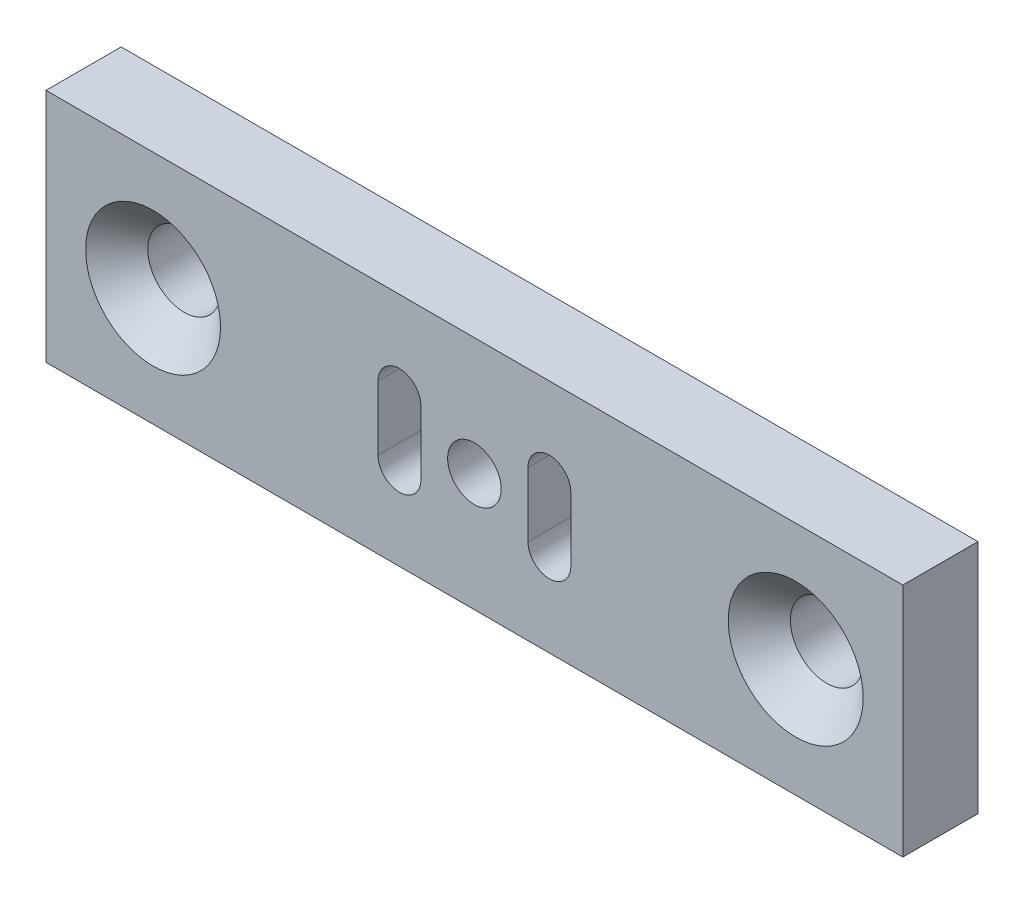
ISO-10303-21;
HEADER;
FILE_DESCRIPTION(('STEP AP214'),'2;1');
FILE_NAME('part.step','',(''),(''),'','','');
FILE_SCHEMA(('AUTOMOTIVE_DESIGN { 1 0 10303 214 1 1 1 1 }'));
ENDSEC;
DATA;
#1=APPLICATION_CONTEXT('core data for automotive mechanical design processes');
#2=APPLICATION_PROTOCOL_DEFINITION('international standard','automotive_design',2000,#1);
#3=PRODUCT_CONTEXT('',#1,'mechanical');
#4=PRODUCT('Part','Part','',(#3));
#5=PRODUCT_RELATED_PRODUCT_CATEGORY('part','',(#4));
#6=PRODUCT_DEFINITION_FORMATION('','',#4);
#7=PRODUCT_DEFINITION_CONTEXT('part definition',#1,'design');
#8=PRODUCT_DEFINITION('design','',#6,#7);
#9=PRODUCT_DEFINITION_SHAPE('','',#8);
#10=(LENGTH_UNIT() NAMED_UNIT(*) SI_UNIT(.MILLI.,.METRE.));
#11=(NAMED_UNIT(*) PLANE_ANGLE_UNIT() SI_UNIT($,.RADIAN.));
#12=(NAMED_UNIT(*) SI_UNIT($,.STERADIAN.) SOLID_ANGLE_UNIT());
#13=UNCERTAINTY_MEASURE_WITH_UNIT(LENGTH_MEASURE(1.E-05),#10,'distance_accuracy_value','');
#14=(GEOMETRIC_REPRESENTATION_CONTEXT(3) GLOBAL_UNCERTAINTY_ASSIGNED_CONTEXT((#13)) GLOBAL_UNIT_ASSIGNED_CONTEXT((#10,
#11,#12)) REPRESENTATION_CONTEXT('',''));
#15=CARTESIAN_POINT('',(0.,0.,0.));
#16=DIRECTION('',(0.,0.,1.));
#17=DIRECTION('',(1.,0.,0.));
#18=AXIS2_PLACEMENT_3D('',#15,#16,#17);
#19=CARTESIAN_POINT('',(-20.,-5.5,9.51));
#20=DIRECTION('',(1.,0.,0.));
#21=DIRECTION('',(0.,1.,0.));
#22=AXIS2_PLACEMENT_3D('',#19,#20,#21);
#23=PLANE('',#22);
#24=DIRECTION('',(0.,1.,0.));
#25=VECTOR('',#24,1.);
#26=CARTESIAN_POINT('',(-20.,-5.5,13.));
#27=LINE('',#26,#25);
#28=CARTESIAN_POINT('',(-20.,-5.5,13.));
#29=VERTEX_POINT('',#28);
#30=CARTESIAN_POINT('',(-20.,5.5,13.));
#31=VERTEX_POINT('',#30);
#32=EDGE_CURVE('E48',#29,#31,#27,.T.);
#33=ORIENTED_EDGE('',*,*,#32,.F.);
#34=DIRECTION('',(0.,0.,-1.));
#35=VECTOR('',#34,1.);
#36=CARTESIAN_POINT('',(-20.,-5.5,9.51));
#37=LINE('',#36,#35);
#38=CARTESIAN_POINT('',(-20.,-5.5,16.51));
#39=VERTEX_POINT('',#38);
#40=EDGE_CURVE('E11',#39,#29,#37,.T.);
#41=ORIENTED_EDGE('',*,*,#40,.F.);
#42=DIRECTION('',(0.,-1.,0.));
#43=VECTOR('',#42,1.);
#44=CARTESIAN_POINT('',(-20.,5.5,16.51));
#45=LINE('',#44,#43);
#46=CARTESIAN_POINT('',(-20.,5.5,16.51));
#47=VERTEX_POINT('',#46);
#48=EDGE_CURVE('E177',#47,#39,#45,.T.);
#49=ORIENTED_EDGE('',*,*,#48,.F.);
#50=DIRECTION('',(0.,0.,-1.));
#51=VECTOR('',#50,1.);
#52=CARTESIAN_POINT('',(-20.,5.5,9.51));
#53=LINE('',#52,#51);
#54=EDGE_CURVE('E189',#47,#31,#53,.T.);
#55=ORIENTED_EDGE('',*,*,#54,.T.);
#56=EDGE_LOOP('',(#33,#41,#49,#55));
#57=FACE_BOUND('',#56,.T.);
#58=ADVANCED_FACE('F33',(#57),#23,.F.);
#59=CARTESIAN_POINT('',(20.,-5.5,9.51));
#60=DIRECTION('',(0.,1.,0.));
#61=DIRECTION('',(0.,0.,1.));
#62=AXIS2_PLACEMENT_3D('',#59,#60,#61);
#63=PLANE('',#62);
#64=DIRECTION('',(-1.,0.,0.));
#65=VECTOR('',#64,1.);
#66=CARTESIAN_POINT('',(20.,-5.5,13.));
#67=LINE('',#66,#65);
#68=CARTESIAN_POINT('',(20.,-5.5,13.));
#69=VERTEX_POINT('',#68);
#70=EDGE_CURVE('E205',#69,#29,#67,.T.);
#71=ORIENTED_EDGE('',*,*,#70,.F.);
#72=DIRECTION('',(0.,0.,-1.));
#73=VECTOR('',#72,1.);
#74=CARTESIAN_POINT('',(20.,-5.5,9.51));
#75=LINE('',#74,#73);
#76=CARTESIAN_POINT('',(20.,-5.5,16.51));
#77=VERTEX_POINT('',#76);
#78=EDGE_CURVE('E41',#77,#69,#75,.T.);
#79=ORIENTED_EDGE('',*,*,#78,.F.);
#80=DIRECTION('',(1.,0.,0.));
#81=VECTOR('',#80,1.);
#82=CARTESIAN_POINT('',(-20.,-5.5,16.51));
#83=LINE('',#82,#81);
#84=EDGE_CURVE('E180',#39,#77,#83,.T.);
#85=ORIENTED_EDGE('',*,*,#84,.F.);
#86=ORIENTED_EDGE('',*,*,#40,.T.);
#87=EDGE_LOOP('',(#71,#79,#85,#86));
#88=FACE_BOUND('',#87,.T.);
#89=ADVANCED_FACE('F204',(#88),#63,.F.);
#90=CARTESIAN_POINT('',(20.,-5.5,9.51));
#91=DIRECTION('',(-1.,0.,0.));
#92=DIRECTION('',(0.,0.,1.));
#93=AXIS2_PLACEMENT_3D('',#90,#91,#92);
#94=PLANE('',#93);
#95=DIRECTION('',(0.,-1.,0.));
#96=VECTOR('',#95,1.);
#97=CARTESIAN_POINT('',(20.,-5.5,13.));
#98=LINE('',#97,#96);
#99=CARTESIAN_POINT('',(20.,5.5,13.));
#100=VERTEX_POINT('',#99);
#101=EDGE_CURVE('E200',#100,#69,#98,.T.);
#102=ORIENTED_EDGE('',*,*,#101,.F.);
#103=DIRECTION('',(0.,0.,-1.));
#104=VECTOR('',#103,1.);
#105=CARTESIAN_POINT('',(20.,5.5,9.51));
#106=LINE('',#105,#104);
#107=CARTESIAN_POINT('',(20.,5.5,16.51));
#108=VERTEX_POINT('',#107);
#109=EDGE_CURVE('E192',#108,#100,#106,.T.);
#110=ORIENTED_EDGE('',*,*,#109,.F.);
#111=DIRECTION('',(0.,1.,0.));
#112=VECTOR('',#111,1.);
#113=CARTESIAN_POINT('',(20.,5.5,16.51));
#114=LINE('',#113,#112);
#115=EDGE_CURVE('E183',#77,#108,#114,.T.);
#116=ORIENTED_EDGE('',*,*,#115,.F.);
#117=ORIENTED_EDGE('',*,*,#78,.T.);
#118=EDGE_LOOP('',(#102,#110,#116,#117));
#119=FACE_BOUND('',#118,.T.);
#120=ADVANCED_FACE('F199',(#119),#94,.F.);
#121=CARTESIAN_POINT('',(20.,5.5,9.51));
#122=DIRECTION('',(0.,-1.,0.));
#123=DIRECTION('',(0.,0.,-1.));
#124=AXIS2_PLACEMENT_3D('',#121,#122,#123);
#125=PLANE('',#124);
#126=DIRECTION('',(1.,0.,0.));
#127=VECTOR('',#126,1.);
#128=CARTESIAN_POINT('',(20.,5.5,13.));
#129=LINE('',#128,#127);
#130=EDGE_CURVE('E264',#31,#100,#129,.T.);
#131=ORIENTED_EDGE('',*,*,#130,.F.);
#132=ORIENTED_EDGE('',*,*,#54,.F.);
#133=DIRECTION('',(-1.,0.,0.));
#134=VECTOR('',#133,1.);
#135=CARTESIAN_POINT('',(-20.,5.5,16.51));
#136=LINE('',#135,#134);
#137=EDGE_CURVE('E186',#108,#47,#136,.T.);
#138=ORIENTED_EDGE('',*,*,#137,.F.);
#139=ORIENTED_EDGE('',*,*,#109,.T.);
#140=EDGE_LOOP('',(#131,#132,#138,#139));
#141=FACE_BOUND('',#140,.T.);
#142=ADVANCED_FACE('F258',(#141),#125,.F.);
#143=CARTESIAN_POINT('',(0.,0.,16.51));
#144=DIRECTION('',(0.,0.,1.));
#145=DIRECTION('',(1.,0.,0.));
#146=AXIS2_PLACEMENT_3D('',#143,#144,#145);
#147=CYLINDRICAL_SURFACE('',#146,1.24999999999999);
#148=CARTESIAN_POINT('',(0.,0.,16.51));
#149=DIRECTION('',(0.,0.,1.));
#150=DIRECTION('',(1.,0.,0.));
#151=AXIS2_PLACEMENT_3D('',#148,#149,#150);
#152=CIRCLE('',#151,1.24999999999999);
#153=CARTESIAN_POINT('',(1.24999999999999,0.,16.51));
#154=VERTEX_POINT('',#153);
#155=EDGE_CURVE('E169',#154,#154,#152,.T.);
#156=ORIENTED_EDGE('',*,*,#155,.T.);
#157=EDGE_LOOP('',(#156));
#158=FACE_BOUND('',#157,.T.);
#159=CARTESIAN_POINT('',(0.,0.,13.));
#160=DIRECTION('',(0.,0.,-1.));
#161=DIRECTION('',(-1.,0.,0.));
#162=AXIS2_PLACEMENT_3D('',#159,#160,#161);
#163=CIRCLE('',#162,1.24999999999999);
#164=CARTESIAN_POINT('',(-1.24999999999999,0.,13.));
#165=VERTEX_POINT('',#164);
#166=EDGE_CURVE('E262',#165,#165,#163,.F.);
#167=ORIENTED_EDGE('',*,*,#166,.F.);
#168=EDGE_LOOP('',(#167));
#169=FACE_BOUND('',#168,.T.);
#170=ADVANCED_FACE('F254',(#158,#169),#147,.F.);
#171=CARTESIAN_POINT('',(-3.5,1.5,9.51));
#172=DIRECTION('',(0.,0.,1.));
#173=DIRECTION('',(1.,0.,0.));
#174=AXIS2_PLACEMENT_3D('',#171,#172,#173);
#175=CYLINDRICAL_SURFACE('',#174,1.);
#176=CARTESIAN_POINT('',(-3.5,1.5,13.));
#177=DIRECTION('',(0.,0.,-1.));
#178=DIRECTION('',(-1.,0.,0.));
#179=AXIS2_PLACEMENT_3D('',#176,#177,#178);
#180=CIRCLE('',#179,1.);
#181=CARTESIAN_POINT('',(-2.5,1.5,13.));
#182=VERTEX_POINT('',#181);
#183=CARTESIAN_POINT('',(-4.5,1.5,13.));
#184=VERTEX_POINT('',#183);
#185=EDGE_CURVE('E56',#182,#184,#180,.F.);
#186=ORIENTED_EDGE('',*,*,#185,.F.);
#187=DIRECTION('',(0.,0.,1.));
#188=VECTOR('',#187,1.);
#189=CARTESIAN_POINT('',(-2.5,1.5,9.51));
#190=LINE('',#189,#188);
#191=CARTESIAN_POINT('',(-2.5,1.5,16.51));
#192=VERTEX_POINT('',#191);
#193=EDGE_CURVE('E167',#182,#192,#190,.T.);
#194=ORIENTED_EDGE('',*,*,#193,.T.);
#195=CARTESIAN_POINT('',(-3.5,1.5,16.51));
#196=DIRECTION('',(0.,0.,1.));
#197=DIRECTION('',(1.,0.,0.));
#198=AXIS2_PLACEMENT_3D('',#195,#196,#197);
#199=CIRCLE('',#198,1.);
#200=CARTESIAN_POINT('',(-4.5,1.5,16.51));
#201=VERTEX_POINT('',#200);
#202=EDGE_CURVE('E154',#192,#201,#199,.T.);
#203=ORIENTED_EDGE('',*,*,#202,.T.);
#204=DIRECTION('',(0.,0.,1.));
#205=VECTOR('',#204,1.);
#206=CARTESIAN_POINT('',(-4.5,1.5,9.51));
#207=LINE('',#206,#205);
#208=EDGE_CURVE('E166',#184,#201,#207,.T.);
#209=ORIENTED_EDGE('',*,*,#208,.F.);
#210=EDGE_LOOP('',(#186,#194,#203,#209));
#211=FACE_BOUND('',#210,.T.);
#212=ADVANCED_FACE('F257',(#211),#175,.F.);
#213=CARTESIAN_POINT('',(-2.5,1.5,9.51));
#214=DIRECTION('',(1.,0.,0.));
#215=DIRECTION('',(0.,1.,0.));
#216=AXIS2_PLACEMENT_3D('',#213,#214,#215);
#217=PLANE('',#216);
#218=DIRECTION('',(0.,1.,0.));
#219=VECTOR('',#218,1.);
#220=CARTESIAN_POINT('',(-2.5,1.5,13.));
#221=LINE('',#220,#219);
#222=CARTESIAN_POINT('',(-2.5,-1.5,13.));
#223=VERTEX_POINT('',#222);
#224=EDGE_CURVE('E267',#223,#182,#221,.T.);
#225=ORIENTED_EDGE('',*,*,#224,.F.);
#226=DIRECTION('',(0.,0.,1.));
#227=VECTOR('',#226,1.);
#228=CARTESIAN_POINT('',(-2.5,-1.5,9.51));
#229=LINE('',#228,#227);
#230=CARTESIAN_POINT('',(-2.5,-1.5,16.51));
#231=VERTEX_POINT('',#230);
#232=EDGE_CURVE('E170',#223,#231,#229,.T.);
#233=ORIENTED_EDGE('',*,*,#232,.T.);
#234=DIRECTION('',(0.,1.,0.));
#235=VECTOR('',#234,1.);
#236=CARTESIAN_POINT('',(-2.5,1.5,16.51));
#237=LINE('',#236,#235);
#238=EDGE_CURVE('E163',#231,#192,#237,.T.);
#239=ORIENTED_EDGE('',*,*,#238,.T.);
#240=ORIENTED_EDGE('',*,*,#193,.F.);
#241=EDGE_LOOP('',(#225,#233,#239,#240));
#242=FACE_BOUND('',#241,.T.);
#243=ADVANCED_FACE('F309',(#242),#217,.F.);
#244=CARTESIAN_POINT('',(-3.5,-1.5,9.51));
#245=DIRECTION('',(0.,0.,1.));
#246=DIRECTION('',(1.,0.,0.));
#247=AXIS2_PLACEMENT_3D('',#244,#245,#246);
#248=CYLINDRICAL_SURFACE('',#247,1.);
#249=CARTESIAN_POINT('',(-3.5,-1.5,13.));
#250=DIRECTION('',(0.,0.,-1.));
#251=DIRECTION('',(-1.,0.,0.));
#252=AXIS2_PLACEMENT_3D('',#249,#250,#251);
#253=CIRCLE('',#252,1.);
#254=CARTESIAN_POINT('',(-4.5,-1.5,13.));
#255=VERTEX_POINT('',#254);
#256=EDGE_CURVE('E443',#255,#223,#253,.F.);
#257=ORIENTED_EDGE('',*,*,#256,.F.);
#258=DIRECTION('',(0.,0.,1.));
#259=VECTOR('',#258,1.);
#260=CARTESIAN_POINT('',(-4.5,-1.5,9.51));
#261=LINE('',#260,#259);
#262=CARTESIAN_POINT('',(-4.5,-1.5,16.51));
#263=VERTEX_POINT('',#262);
#264=EDGE_CURVE('E172',#255,#263,#261,.T.);
#265=ORIENTED_EDGE('',*,*,#264,.T.);
#266=CARTESIAN_POINT('',(-3.5,-1.5,16.51));
#267=DIRECTION('',(0.,0.,1.));
#268=DIRECTION('',(1.,0.,0.));
#269=AXIS2_PLACEMENT_3D('',#266,#267,#268);
#270=CIRCLE('',#269,1.);
#271=EDGE_CURVE('E160',#263,#231,#270,.T.);
#272=ORIENTED_EDGE('',*,*,#271,.T.);
#273=ORIENTED_EDGE('',*,*,#232,.F.);
#274=EDGE_LOOP('',(#257,#265,#272,#273));
#275=FACE_BOUND('',#274,.T.);
#276=ADVANCED_FACE('F319',(#275),#248,.F.);
#277=CARTESIAN_POINT('',(-4.5,1.5,9.51));
#278=DIRECTION('',(-1.,0.,0.));
#279=DIRECTION('',(0.,0.,1.));
#280=AXIS2_PLACEMENT_3D('',#277,#278,#279);
#281=PLANE('',#280);
#282=DIRECTION('',(0.,-1.,0.));
#283=VECTOR('',#282,1.);
#284=CARTESIAN_POINT('',(-4.5,1.5,13.));
#285=LINE('',#284,#283);
#286=EDGE_CURVE('E441',#184,#255,#285,.T.);
#287=ORIENTED_EDGE('',*,*,#286,.F.);
#288=ORIENTED_EDGE('',*,*,#208,.T.);
#289=DIRECTION('',(0.,-1.,0.));
#290=VECTOR('',#289,1.);
#291=CARTESIAN_POINT('',(-4.5,1.5,16.51));
#292=LINE('',#291,#290);
#293=EDGE_CURVE('E157',#201,#263,#292,.T.);
#294=ORIENTED_EDGE('',*,*,#293,.T.);
#295=ORIENTED_EDGE('',*,*,#264,.F.);
#296=EDGE_LOOP('',(#287,#288,#294,#295));
#297=FACE_BOUND('',#296,.T.);
#298=ADVANCED_FACE('F329',(#297),#281,.F.);
#299=CARTESIAN_POINT('',(3.5,1.5,9.51));
#300=DIRECTION('',(0.,0.,1.));
#301=DIRECTION('',(1.,0.,0.));
#302=AXIS2_PLACEMENT_3D('',#299,#300,#301);
#303=CYLINDRICAL_SURFACE('',#302,1.);
#304=CARTESIAN_POINT('',(3.5,1.5,13.));
#305=DIRECTION('',(0.,0.,-1.));
#306=DIRECTION('',(-1.,0.,0.));
#307=AXIS2_PLACEMENT_3D('',#304,#305,#306);
#308=CIRCLE('',#307,1.);
#309=CARTESIAN_POINT('',(4.5,1.5,13.));
#310=VERTEX_POINT('',#309);
#311=CARTESIAN_POINT('',(2.5,1.5,13.));
#312=VERTEX_POINT('',#311);
#313=EDGE_CURVE('E127',#310,#312,#308,.F.);
#314=ORIENTED_EDGE('',*,*,#313,.F.);
#315=DIRECTION('',(0.,0.,1.));
#316=VECTOR('',#315,1.);
#317=CARTESIAN_POINT('',(4.5,1.5,9.51));
#318=LINE('',#317,#316);
#319=CARTESIAN_POINT('',(4.5,1.5,16.51));
#320=VERTEX_POINT('',#319);
#321=EDGE_CURVE('E148',#310,#320,#318,.T.);
#322=ORIENTED_EDGE('',*,*,#321,.T.);
#323=CARTESIAN_POINT('',(3.5,1.5,16.51));
#324=DIRECTION('',(0.,0.,1.));
#325=DIRECTION('',(1.,0.,0.));
#326=AXIS2_PLACEMENT_3D('',#323,#324,#325);
#327=CIRCLE('',#326,1.);
#328=CARTESIAN_POINT('',(2.5,1.5,16.51));
#329=VERTEX_POINT('',#328);
#330=EDGE_CURVE('E227',#320,#329,#327,.T.);
#331=ORIENTED_EDGE('',*,*,#330,.T.);
#332=DIRECTION('',(0.,0.,1.));
#333=VECTOR('',#332,1.);
#334=CARTESIAN_POINT('',(2.5,1.5,9.51));
#335=LINE('',#334,#333);
#336=EDGE_CURVE('E146',#312,#329,#335,.T.);
#337=ORIENTED_EDGE('',*,*,#336,.F.);
#338=EDGE_LOOP('',(#314,#322,#331,#337));
#339=FACE_BOUND('',#338,.T.);
#340=ADVANCED_FACE('F236',(#339),#303,.F.);
#341=CARTESIAN_POINT('',(4.5,1.5,9.51));
#342=DIRECTION('',(1.,0.,0.));
#343=DIRECTION('',(0.,1.,0.));
#344=AXIS2_PLACEMENT_3D('',#341,#342,#343);
#345=PLANE('',#344);
#346=DIRECTION('',(0.,1.,0.));
#347=VECTOR('',#346,1.);
#348=CARTESIAN_POINT('',(4.5,1.5,13.));
#349=LINE('',#348,#347);
#350=CARTESIAN_POINT('',(4.5,-1.5,13.));
#351=VERTEX_POINT('',#350);
#352=EDGE_CURVE('E140',#351,#310,#349,.T.);
#353=ORIENTED_EDGE('',*,*,#352,.F.);
#354=DIRECTION('',(0.,0.,1.));
#355=VECTOR('',#354,1.);
#356=CARTESIAN_POINT('',(4.5,-1.5,9.51));
#357=LINE('',#356,#355);
#358=CARTESIAN_POINT('',(4.5,-1.5,16.51));
#359=VERTEX_POINT('',#358);
#360=EDGE_CURVE('E139',#351,#359,#357,.T.);
#361=ORIENTED_EDGE('',*,*,#360,.T.);
#362=DIRECTION('',(0.,1.,0.));
#363=VECTOR('',#362,1.);
#364=CARTESIAN_POINT('',(4.5,1.5,16.51));
#365=LINE('',#364,#363);
#366=EDGE_CURVE('E150',#359,#320,#365,.T.);
#367=ORIENTED_EDGE('',*,*,#366,.T.);
#368=ORIENTED_EDGE('',*,*,#321,.F.);
#369=EDGE_LOOP('',(#353,#361,#367,#368));
#370=FACE_BOUND('',#369,.T.);
#371=ADVANCED_FACE('F240',(#370),#345,.F.);
#372=CARTESIAN_POINT('',(3.5,-1.5,9.51));
#373=DIRECTION('',(0.,0.,1.));
#374=DIRECTION('',(1.,0.,0.));
#375=AXIS2_PLACEMENT_3D('',#372,#373,#374);
#376=CYLINDRICAL_SURFACE('',#375,1.);
#377=CARTESIAN_POINT('',(3.5,-1.5,13.));
#378=DIRECTION('',(0.,0.,-1.));
#379=DIRECTION('',(-1.,0.,0.));
#380=AXIS2_PLACEMENT_3D('',#377,#378,#379);
#381=CIRCLE('',#380,1.);
#382=CARTESIAN_POINT('',(2.5,-1.5,13.));
#383=VERTEX_POINT('',#382);
#384=EDGE_CURVE('E124',#383,#351,#381,.F.);
#385=ORIENTED_EDGE('',*,*,#384,.F.);
#386=DIRECTION('',(0.,0.,1.));
#387=VECTOR('',#386,1.);
#388=CARTESIAN_POINT('',(2.5,-1.5,9.51));
#389=LINE('',#388,#387);
#390=CARTESIAN_POINT('',(2.5,-1.5,16.51));
#391=VERTEX_POINT('',#390);
#392=EDGE_CURVE('E137',#383,#391,#389,.T.);
#393=ORIENTED_EDGE('',*,*,#392,.T.);
#394=CARTESIAN_POINT('',(3.5,-1.5,16.51));
#395=DIRECTION('',(0.,0.,1.));
#396=DIRECTION('',(1.,0.,0.));
#397=AXIS2_PLACEMENT_3D('',#394,#395,#396);
#398=CIRCLE('',#397,1.);
#399=EDGE_CURVE('E231',#391,#359,#398,.T.);
#400=ORIENTED_EDGE('',*,*,#399,.T.);
#401=ORIENTED_EDGE('',*,*,#360,.F.);
#402=EDGE_LOOP('',(#385,#393,#400,#401));
#403=FACE_BOUND('',#402,.T.);
#404=ADVANCED_FACE('F135',(#403),#376,.F.);
#405=CARTESIAN_POINT('',(2.5,1.5,9.51));
#406=DIRECTION('',(-1.,0.,0.));
#407=DIRECTION('',(0.,0.,1.));
#408=AXIS2_PLACEMENT_3D('',#405,#406,#407);
#409=PLANE('',#408);
#410=DIRECTION('',(0.,-1.,0.));
#411=VECTOR('',#410,1.);
#412=CARTESIAN_POINT('',(2.5,1.5,13.));
#413=LINE('',#412,#411);
#414=EDGE_CURVE('E121',#312,#383,#413,.T.);
#415=ORIENTED_EDGE('',*,*,#414,.F.);
#416=ORIENTED_EDGE('',*,*,#336,.T.);
#417=DIRECTION('',(0.,-1.,0.));
#418=VECTOR('',#417,1.);
#419=CARTESIAN_POINT('',(2.5,1.5,16.51));
#420=LINE('',#419,#418);
#421=EDGE_CURVE('E144',#329,#391,#420,.T.);
#422=ORIENTED_EDGE('',*,*,#421,.T.);
#423=ORIENTED_EDGE('',*,*,#392,.F.);
#424=EDGE_LOOP('',(#415,#416,#422,#423));
#425=FACE_BOUND('',#424,.T.);
#426=ADVANCED_FACE('F142',(#425),#409,.F.);
#427=CARTESIAN_POINT('',(15.,0.,16.51));
#428=DIRECTION('',(0.,0.,1.));
#429=DIRECTION('',(1.,0.,0.));
#430=AXIS2_PLACEMENT_3D('',#427,#428,#429);
#431=CYLINDRICAL_SURFACE('',#430,1.7);
#432=CARTESIAN_POINT('',(15.,0.,15.06));
#433=DIRECTION('',(0.,0.,1.));
#434=DIRECTION('',(1.,0.,0.));
#435=AXIS2_PLACEMENT_3D('',#432,#433,#434);
#436=CIRCLE('',#435,1.7);
#437=CARTESIAN_POINT('',(16.7,0.,15.06));
#438=VERTEX_POINT('',#437);
#439=EDGE_CURVE('E224',#438,#438,#436,.T.);
#440=ORIENTED_EDGE('',*,*,#439,.T.);
#441=EDGE_LOOP('',(#440));
#442=FACE_BOUND('',#441,.T.);
#443=CARTESIAN_POINT('',(15.,0.,13.));
#444=DIRECTION('',(0.,0.,-1.));
#445=DIRECTION('',(-1.,0.,0.));
#446=AXIS2_PLACEMENT_3D('',#443,#444,#445);
#447=CIRCLE('',#446,1.7);
#448=CARTESIAN_POINT('',(13.3,0.,13.));
#449=VERTEX_POINT('',#448);
#450=EDGE_CURVE('E131',#449,#449,#447,.F.);
#451=ORIENTED_EDGE('',*,*,#450,.F.);
#452=EDGE_LOOP('',(#451));
#453=FACE_BOUND('',#452,.T.);
#454=ADVANCED_FACE('F372',(#442,#453),#431,.F.);
#455=CARTESIAN_POINT('',(-15.,0.,16.51));
#456=DIRECTION('',(0.,0.,1.));
#457=DIRECTION('',(1.,0.,0.));
#458=AXIS2_PLACEMENT_3D('',#455,#456,#457);
#459=CYLINDRICAL_SURFACE('',#458,1.7);
#460=CARTESIAN_POINT('',(-15.,0.,15.06));
#461=DIRECTION('',(0.,0.,1.));
#462=DIRECTION('',(1.,0.,0.));
#463=AXIS2_PLACEMENT_3D('',#460,#461,#462);
#464=CIRCLE('',#463,1.7);
#465=CARTESIAN_POINT('',(-13.3,0.,15.06));
#466=VERTEX_POINT('',#465);
#467=EDGE_CURVE('E214',#466,#466,#464,.T.);
#468=ORIENTED_EDGE('',*,*,#467,.T.);
#469=EDGE_LOOP('',(#468));
#470=FACE_BOUND('',#469,.T.);
#471=CARTESIAN_POINT('',(-15.,0.,13.));
#472=DIRECTION('',(0.,0.,-1.));
#473=DIRECTION('',(-1.,0.,0.));
#474=AXIS2_PLACEMENT_3D('',#471,#472,#473);
#475=CIRCLE('',#474,1.7);
#476=CARTESIAN_POINT('',(-16.7,0.,13.));
#477=VERTEX_POINT('',#476);
#478=EDGE_CURVE('E36',#477,#477,#475,.F.);
#479=ORIENTED_EDGE('',*,*,#478,.F.);
#480=EDGE_LOOP('',(#479));
#481=FACE_BOUND('',#480,.T.);
#482=ADVANCED_FACE('F245',(#470,#481),#459,.F.);
#483=CARTESIAN_POINT('',(0.,0.,16.51));
#484=DIRECTION('',(0.,0.,1.));
#485=DIRECTION('',(1.,0.,0.));
#486=AXIS2_PLACEMENT_3D('',#483,#484,#485);
#487=PLANE('',#486);
#488=CARTESIAN_POINT('',(-15.,0.,16.51));
#489=DIRECTION('',(0.,0.,1.));
#490=DIRECTION('',(1.,0.,0.));
#491=AXIS2_PLACEMENT_3D('',#488,#489,#490);
#492=CIRCLE('',#491,3.15);
#493=CARTESIAN_POINT('',(-11.85,0.,16.51));
#494=VERTEX_POINT('',#493);
#495=EDGE_CURVE('E211',#494,#494,#492,.T.);
#496=ORIENTED_EDGE('',*,*,#495,.F.);
#497=EDGE_LOOP('',(#496));
#498=FACE_BOUND('',#497,.T.);
#499=CARTESIAN_POINT('',(15.,0.,16.51));
#500=DIRECTION('',(0.,0.,1.));
#501=DIRECTION('',(1.,0.,0.));
#502=AXIS2_PLACEMENT_3D('',#499,#500,#501);
#503=CIRCLE('',#502,3.15);
#504=CARTESIAN_POINT('',(18.15,0.,16.51));
#505=VERTEX_POINT('',#504);
#506=EDGE_CURVE('E221',#505,#505,#503,.T.);
#507=ORIENTED_EDGE('',*,*,#506,.F.);
#508=EDGE_LOOP('',(#507));
#509=FACE_BOUND('',#508,.T.);
#510=ORIENTED_EDGE('',*,*,#330,.F.);
#511=ORIENTED_EDGE('',*,*,#366,.F.);
#512=ORIENTED_EDGE('',*,*,#399,.F.);
#513=ORIENTED_EDGE('',*,*,#421,.F.);
#514=EDGE_LOOP('',(#510,#511,#512,#513));
#515=FACE_BOUND('',#514,.T.);
#516=ORIENTED_EDGE('',*,*,#202,.F.);
#517=ORIENTED_EDGE('',*,*,#238,.F.);
#518=ORIENTED_EDGE('',*,*,#271,.F.);
#519=ORIENTED_EDGE('',*,*,#293,.F.);
#520=EDGE_LOOP('',(#516,#517,#518,#519));
#521=FACE_BOUND('',#520,.T.);
#522=ORIENTED_EDGE('',*,*,#155,.F.);
#523=EDGE_LOOP('',(#522));
#524=FACE_BOUND('',#523,.T.);
#525=ORIENTED_EDGE('',*,*,#48,.T.);
#526=ORIENTED_EDGE('',*,*,#84,.T.);
#527=ORIENTED_EDGE('',*,*,#115,.T.);
#528=ORIENTED_EDGE('',*,*,#137,.T.);
#529=EDGE_LOOP('',(#525,#526,#527,#528));
#530=FACE_BOUND('',#529,.T.);
#531=ADVANCED_FACE('F207',(#498,#509,#515,#521,#524,#530),#487,.T.);
#532=CARTESIAN_POINT('',(15.,0.,16.51));
#533=DIRECTION('',(0.,0.,1.));
#534=DIRECTION('',(1.,0.,0.));
#535=AXIS2_PLACEMENT_3D('',#532,#533,#534);
#536=CONICAL_SURFACE('',#535,3.15,0.785398163397447);
#537=ORIENTED_EDGE('',*,*,#439,.F.);
#538=EDGE_LOOP('',(#537));
#539=FACE_BOUND('',#538,.T.);
#540=ORIENTED_EDGE('',*,*,#506,.T.);
#541=EDGE_LOOP('',(#540));
#542=FACE_BOUND('',#541,.T.);
#543=ADVANCED_FACE('F244',(#539,#542),#536,.F.);
#544=CARTESIAN_POINT('',(-15.,0.,16.51));
#545=DIRECTION('',(0.,0.,1.));
#546=DIRECTION('',(1.,0.,0.));
#547=AXIS2_PLACEMENT_3D('',#544,#545,#546);
#548=CONICAL_SURFACE('',#547,3.15,0.785398163397447);
#549=ORIENTED_EDGE('',*,*,#467,.F.);
#550=EDGE_LOOP('',(#549));
#551=FACE_BOUND('',#550,.T.);
#552=ORIENTED_EDGE('',*,*,#495,.T.);
#553=EDGE_LOOP('',(#552));
#554=FACE_BOUND('',#553,.T.);
#555=ADVANCED_FACE('F399',(#551,#554),#548,.F.);
#556=CARTESIAN_POINT('',(0.,0.,13.));
#557=DIRECTION('',(0.,0.,-1.));
#558=DIRECTION('',(-1.,0.,0.));
#559=AXIS2_PLACEMENT_3D('',#556,#557,#558);
#560=PLANE('',#559);
#561=ORIENTED_EDGE('',*,*,#166,.T.);
#562=EDGE_LOOP('',(#561));
#563=FACE_BOUND('',#562,.T.);
#564=ORIENTED_EDGE('',*,*,#185,.T.);
#565=ORIENTED_EDGE('',*,*,#286,.T.);
#566=ORIENTED_EDGE('',*,*,#256,.T.);
#567=ORIENTED_EDGE('',*,*,#224,.T.);
#568=EDGE_LOOP('',(#564,#565,#566,#567));
#569=FACE_BOUND('',#568,.T.);
#570=ORIENTED_EDGE('',*,*,#450,.T.);
#571=EDGE_LOOP('',(#570));
#572=FACE_BOUND('',#571,.T.);
#573=ORIENTED_EDGE('',*,*,#478,.T.);
#574=EDGE_LOOP('',(#573));
#575=FACE_BOUND('',#574,.T.);
#576=ORIENTED_EDGE('',*,*,#313,.T.);
#577=ORIENTED_EDGE('',*,*,#414,.T.);
#578=ORIENTED_EDGE('',*,*,#384,.T.);
#579=ORIENTED_EDGE('',*,*,#352,.T.);
#580=EDGE_LOOP('',(#576,#577,#578,#579));
#581=FACE_BOUND('',#580,.T.);
#582=ORIENTED_EDGE('',*,*,#32,.T.);
#583=ORIENTED_EDGE('',*,*,#130,.T.);
#584=ORIENTED_EDGE('',*,*,#101,.T.);
#585=ORIENTED_EDGE('',*,*,#70,.T.);
#586=EDGE_LOOP('',(#582,#583,#584,#585));
#587=FACE_BOUND('',#586,.T.);
#588=ADVANCED_FACE('F123',(#563,#569,#572,#575,#581,#587),#560,.T.);
#589=CLOSED_SHELL('',(#58,#89,#120,#142,#170,#212,#243,#276,#298,#340,#371,#404,#426,#454,#482,
#531,#543,#555,#588));
#590=MANIFOLD_SOLID_BREP('B2',#589);
#591=ADVANCED_BREP_SHAPE_REPRESENTATION('',(#18,#590),#14);
#592=SHAPE_DEFINITION_REPRESENTATION(#9,#591);
ENDSEC;
END-ISO-10303-21;
